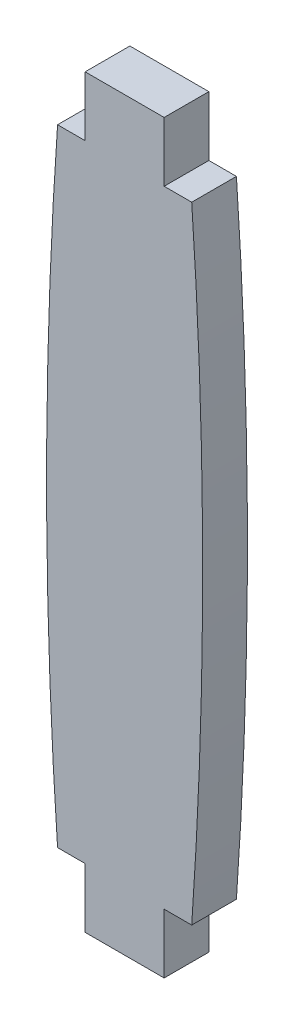
ISO-10303-21;
HEADER;
FILE_DESCRIPTION(('STEP AP214'),'2;1');
FILE_NAME('part.step','',(''),(''),'','','');
FILE_SCHEMA(('AUTOMOTIVE_DESIGN { 1 0 10303 214 1 1 1 1 }'));
ENDSEC;
DATA;
#1=APPLICATION_CONTEXT('core data for automotive mechanical design processes');
#2=APPLICATION_PROTOCOL_DEFINITION('international standard','automotive_design',2000,#1);
#3=PRODUCT_CONTEXT('',#1,'mechanical');
#4=PRODUCT('Part','Part','',(#3));
#5=PRODUCT_RELATED_PRODUCT_CATEGORY('part','',(#4));
#6=PRODUCT_DEFINITION_FORMATION('','',#4);
#7=PRODUCT_DEFINITION_CONTEXT('part definition',#1,'design');
#8=PRODUCT_DEFINITION('design','',#6,#7);
#9=PRODUCT_DEFINITION_SHAPE('','',#8);
#10=(LENGTH_UNIT() NAMED_UNIT(*) SI_UNIT(.MILLI.,.METRE.));
#11=(NAMED_UNIT(*) PLANE_ANGLE_UNIT() SI_UNIT($,.RADIAN.));
#12=(NAMED_UNIT(*) SI_UNIT($,.STERADIAN.) SOLID_ANGLE_UNIT());
#13=UNCERTAINTY_MEASURE_WITH_UNIT(LENGTH_MEASURE(1.E-05),#10,'distance_accuracy_value','');
#14=(GEOMETRIC_REPRESENTATION_CONTEXT(3) GLOBAL_UNCERTAINTY_ASSIGNED_CONTEXT((#13)) GLOBAL_UNIT_ASSIGNED_CONTEXT((#10,
#11,#12)) REPRESENTATION_CONTEXT('',''));
#15=CARTESIAN_POINT('',(0.,0.,0.));
#16=DIRECTION('',(0.,0.,1.));
#17=DIRECTION('',(1.,0.,0.));
#18=AXIS2_PLACEMENT_3D('',#15,#16,#17);
#19=CARTESIAN_POINT('',(299.264097412302,21.,3.));
#20=DIRECTION('',(0.,0.,-1.));
#21=DIRECTION('',(-1.,0.,0.));
#22=AXIS2_PLACEMENT_3D('',#19,#20,#21);
#23=CYLINDRICAL_SURFACE('',#22,300.);
#24=CARTESIAN_POINT('',(299.264097412302,21.,0.));
#25=DIRECTION('',(0.,0.,1.));
#26=DIRECTION('',(-1.,0.,0.));
#27=AXIS2_PLACEMENT_3D('',#24,#25,#26);
#28=CIRCLE('',#27,300.);
#29=CARTESIAN_POINT('',(0.,42.,0.));
#30=VERTEX_POINT('',#29);
#31=CARTESIAN_POINT('',(0.,0.,0.));
#32=VERTEX_POINT('',#31);
#33=EDGE_CURVE('E164',#30,#32,#28,.T.);
#34=ORIENTED_EDGE('',*,*,#33,.T.);
#35=DIRECTION('',(0.,0.,-1.));
#36=VECTOR('',#35,1.);
#37=CARTESIAN_POINT('',(0.,0.,3.));
#38=LINE('',#37,#36);
#39=CARTESIAN_POINT('',(0.,0.,3.));
#40=VERTEX_POINT('',#39);
#41=EDGE_CURVE('E11',#40,#32,#38,.T.);
#42=ORIENTED_EDGE('',*,*,#41,.F.);
#43=CARTESIAN_POINT('',(299.264097412302,21.,3.));
#44=DIRECTION('',(0.,0.,1.));
#45=DIRECTION('',(-1.,0.,0.));
#46=AXIS2_PLACEMENT_3D('',#43,#44,#45);
#47=CIRCLE('',#46,300.);
#48=CARTESIAN_POINT('',(0.,42.,3.));
#49=VERTEX_POINT('',#48);
#50=EDGE_CURVE('E198',#49,#40,#47,.T.);
#51=ORIENTED_EDGE('',*,*,#50,.F.);
#52=DIRECTION('',(0.,0.,-1.));
#53=VECTOR('',#52,1.);
#54=CARTESIAN_POINT('',(0.,42.,3.));
#55=LINE('',#54,#53);
#56=EDGE_CURVE('E160',#49,#30,#55,.T.);
#57=ORIENTED_EDGE('',*,*,#56,.T.);
#58=EDGE_LOOP('',(#34,#42,#51,#57));
#59=FACE_BOUND('',#58,.T.);
#60=ADVANCED_FACE('F39',(#59),#23,.T.);
#61=CARTESIAN_POINT('',(0.,0.,3.));
#62=DIRECTION('',(0.,1.,0.));
#63=DIRECTION('',(0.,0.,1.));
#64=AXIS2_PLACEMENT_3D('',#61,#62,#63);
#65=PLANE('',#64);
#66=DIRECTION('',(1.,0.,0.));
#67=VECTOR('',#66,1.);
#68=CARTESIAN_POINT('',(0.,0.,0.));
#69=LINE('',#68,#67);
#70=CARTESIAN_POINT('',(1.85,0.,0.));
#71=VERTEX_POINT('',#70);
#72=EDGE_CURVE('E168',#32,#71,#69,.T.);
#73=ORIENTED_EDGE('',*,*,#72,.T.);
#74=DIRECTION('',(0.,0.,-1.));
#75=VECTOR('',#74,1.);
#76=CARTESIAN_POINT('',(1.85,0.,3.));
#77=LINE('',#76,#75);
#78=CARTESIAN_POINT('',(1.85,0.,3.));
#79=VERTEX_POINT('',#78);
#80=EDGE_CURVE('E48',#79,#71,#77,.T.);
#81=ORIENTED_EDGE('',*,*,#80,.F.);
#82=DIRECTION('',(1.,0.,0.));
#83=VECTOR('',#82,1.);
#84=CARTESIAN_POINT('',(0.,0.,3.));
#85=LINE('',#84,#83);
#86=EDGE_CURVE('E111',#40,#79,#85,.T.);
#87=ORIENTED_EDGE('',*,*,#86,.F.);
#88=ORIENTED_EDGE('',*,*,#41,.T.);
#89=EDGE_LOOP('',(#73,#81,#87,#88));
#90=FACE_BOUND('',#89,.T.);
#91=ADVANCED_FACE('F292',(#90),#65,.F.);
#92=CARTESIAN_POINT('',(1.85,0.,3.));
#93=DIRECTION('',(1.,0.,0.));
#94=DIRECTION('',(0.,1.,0.));
#95=AXIS2_PLACEMENT_3D('',#92,#93,#94);
#96=PLANE('',#95);
#97=DIRECTION('',(0.,-1.,0.));
#98=VECTOR('',#97,1.);
#99=CARTESIAN_POINT('',(1.85,0.,0.));
#100=LINE('',#99,#98);
#101=CARTESIAN_POINT('',(1.85,-4.,0.));
#102=VERTEX_POINT('',#101);
#103=EDGE_CURVE('E171',#71,#102,#100,.T.);
#104=ORIENTED_EDGE('',*,*,#103,.T.);
#105=DIRECTION('',(0.,0.,-1.));
#106=VECTOR('',#105,1.);
#107=CARTESIAN_POINT('',(1.85,-4.,3.));
#108=LINE('',#107,#106);
#109=CARTESIAN_POINT('',(1.85,-4.,3.));
#110=VERTEX_POINT('',#109);
#111=EDGE_CURVE('E225',#110,#102,#108,.T.);
#112=ORIENTED_EDGE('',*,*,#111,.F.);
#113=DIRECTION('',(0.,-1.,0.));
#114=VECTOR('',#113,1.);
#115=CARTESIAN_POINT('',(1.85,0.,3.));
#116=LINE('',#115,#114);
#117=EDGE_CURVE('E235',#79,#110,#116,.T.);
#118=ORIENTED_EDGE('',*,*,#117,.F.);
#119=ORIENTED_EDGE('',*,*,#80,.T.);
#120=EDGE_LOOP('',(#104,#112,#118,#119));
#121=FACE_BOUND('',#120,.T.);
#122=ADVANCED_FACE('F233',(#121),#96,.F.);
#123=CARTESIAN_POINT('',(1.85,-4.,3.));
#124=DIRECTION('',(0.,1.,0.));
#125=DIRECTION('',(0.,0.,1.));
#126=AXIS2_PLACEMENT_3D('',#123,#124,#125);
#127=PLANE('',#126);
#128=DIRECTION('',(1.,0.,0.));
#129=VECTOR('',#128,1.);
#130=CARTESIAN_POINT('',(1.85,-4.,0.));
#131=LINE('',#130,#129);
#132=CARTESIAN_POINT('',(7.15,-4.,0.));
#133=VERTEX_POINT('',#132);
#134=EDGE_CURVE('E174',#102,#133,#131,.T.);
#135=ORIENTED_EDGE('',*,*,#134,.T.);
#136=DIRECTION('',(0.,0.,-1.));
#137=VECTOR('',#136,1.);
#138=CARTESIAN_POINT('',(7.15,-4.,3.));
#139=LINE('',#138,#137);
#140=CARTESIAN_POINT('',(7.15,-4.,3.));
#141=VERTEX_POINT('',#140);
#142=EDGE_CURVE('E221',#141,#133,#139,.T.);
#143=ORIENTED_EDGE('',*,*,#142,.F.);
#144=DIRECTION('',(1.,0.,0.));
#145=VECTOR('',#144,1.);
#146=CARTESIAN_POINT('',(1.85,-4.,3.));
#147=LINE('',#146,#145);
#148=EDGE_CURVE('E254',#110,#141,#147,.T.);
#149=ORIENTED_EDGE('',*,*,#148,.F.);
#150=ORIENTED_EDGE('',*,*,#111,.T.);
#151=EDGE_LOOP('',(#135,#143,#149,#150));
#152=FACE_BOUND('',#151,.T.);
#153=ADVANCED_FACE('F244',(#152),#127,.F.);
#154=CARTESIAN_POINT('',(7.15,-4.,3.));
#155=DIRECTION('',(-1.,0.,0.));
#156=DIRECTION('',(0.,0.,1.));
#157=AXIS2_PLACEMENT_3D('',#154,#155,#156);
#158=PLANE('',#157);
#159=DIRECTION('',(0.,1.,0.));
#160=VECTOR('',#159,1.);
#161=CARTESIAN_POINT('',(7.15,-4.,0.));
#162=LINE('',#161,#160);
#163=CARTESIAN_POINT('',(7.15,0.,0.));
#164=VERTEX_POINT('',#163);
#165=EDGE_CURVE('E177',#133,#164,#162,.T.);
#166=ORIENTED_EDGE('',*,*,#165,.T.);
#167=DIRECTION('',(0.,0.,-1.));
#168=VECTOR('',#167,1.);
#169=CARTESIAN_POINT('',(7.15,0.,3.));
#170=LINE('',#169,#168);
#171=CARTESIAN_POINT('',(7.15,0.,3.));
#172=VERTEX_POINT('',#171);
#173=EDGE_CURVE('E217',#172,#164,#170,.T.);
#174=ORIENTED_EDGE('',*,*,#173,.F.);
#175=DIRECTION('',(0.,1.,0.));
#176=VECTOR('',#175,1.);
#177=CARTESIAN_POINT('',(7.15,-4.,3.));
#178=LINE('',#177,#176);
#179=EDGE_CURVE('E250',#141,#172,#178,.T.);
#180=ORIENTED_EDGE('',*,*,#179,.F.);
#181=ORIENTED_EDGE('',*,*,#142,.T.);
#182=EDGE_LOOP('',(#166,#174,#180,#181));
#183=FACE_BOUND('',#182,.T.);
#184=ADVANCED_FACE('F248',(#183),#158,.F.);
#185=CARTESIAN_POINT('',(7.15,0.,3.));
#186=DIRECTION('',(0.,1.,0.));
#187=DIRECTION('',(0.,0.,1.));
#188=AXIS2_PLACEMENT_3D('',#185,#186,#187);
#189=PLANE('',#188);
#190=DIRECTION('',(1.,0.,0.));
#191=VECTOR('',#190,1.);
#192=CARTESIAN_POINT('',(7.15,0.,0.));
#193=LINE('',#192,#191);
#194=CARTESIAN_POINT('',(9.,0.,0.));
#195=VERTEX_POINT('',#194);
#196=EDGE_CURVE('E180',#164,#195,#193,.T.);
#197=ORIENTED_EDGE('',*,*,#196,.T.);
#198=DIRECTION('',(0.,0.,-1.));
#199=VECTOR('',#198,1.);
#200=CARTESIAN_POINT('',(9.,0.,3.));
#201=LINE('',#200,#199);
#202=CARTESIAN_POINT('',(9.,0.,3.));
#203=VERTEX_POINT('',#202);
#204=EDGE_CURVE('E213',#203,#195,#201,.T.);
#205=ORIENTED_EDGE('',*,*,#204,.F.);
#206=DIRECTION('',(1.,0.,0.));
#207=VECTOR('',#206,1.);
#208=CARTESIAN_POINT('',(7.15,0.,3.));
#209=LINE('',#208,#207);
#210=EDGE_CURVE('E253',#172,#203,#209,.T.);
#211=ORIENTED_EDGE('',*,*,#210,.F.);
#212=ORIENTED_EDGE('',*,*,#173,.T.);
#213=EDGE_LOOP('',(#197,#205,#211,#212));
#214=FACE_BOUND('',#213,.T.);
#215=ADVANCED_FACE('F305',(#214),#189,.F.);
#216=CARTESIAN_POINT('',(-290.264097412302,21.,3.));
#217=DIRECTION('',(0.,0.,-1.));
#218=DIRECTION('',(-1.,0.,0.));
#219=AXIS2_PLACEMENT_3D('',#216,#217,#218);
#220=CYLINDRICAL_SURFACE('',#219,300.);
#221=CARTESIAN_POINT('',(-290.264097412302,21.,0.));
#222=DIRECTION('',(0.,0.,1.));
#223=DIRECTION('',(1.,0.,0.));
#224=AXIS2_PLACEMENT_3D('',#221,#222,#223);
#225=CIRCLE('',#224,300.);
#226=CARTESIAN_POINT('',(9.00000000000001,42.,0.));
#227=VERTEX_POINT('',#226);
#228=EDGE_CURVE('E183',#195,#227,#225,.T.);
#229=ORIENTED_EDGE('',*,*,#228,.T.);
#230=DIRECTION('',(0.,0.,-1.));
#231=VECTOR('',#230,1.);
#232=CARTESIAN_POINT('',(9.00000000000001,42.,3.));
#233=LINE('',#232,#231);
#234=CARTESIAN_POINT('',(9.00000000000001,42.,3.));
#235=VERTEX_POINT('',#234);
#236=EDGE_CURVE('E209',#235,#227,#233,.T.);
#237=ORIENTED_EDGE('',*,*,#236,.F.);
#238=CARTESIAN_POINT('',(-290.264097412302,21.,3.));
#239=DIRECTION('',(0.,0.,1.));
#240=DIRECTION('',(1.,0.,0.));
#241=AXIS2_PLACEMENT_3D('',#238,#239,#240);
#242=CIRCLE('',#241,300.);
#243=EDGE_CURVE('E258',#203,#235,#242,.T.);
#244=ORIENTED_EDGE('',*,*,#243,.F.);
#245=ORIENTED_EDGE('',*,*,#204,.T.);
#246=EDGE_LOOP('',(#229,#237,#244,#245));
#247=FACE_BOUND('',#246,.T.);
#248=ADVANCED_FACE('F308',(#247),#220,.T.);
#249=CARTESIAN_POINT('',(7.15000000000001,42.,3.));
#250=DIRECTION('',(0.,-1.,0.));
#251=DIRECTION('',(0.,0.,-1.));
#252=AXIS2_PLACEMENT_3D('',#249,#250,#251);
#253=PLANE('',#252);
#254=DIRECTION('',(-1.,0.,0.));
#255=VECTOR('',#254,1.);
#256=CARTESIAN_POINT('',(7.15000000000001,42.,0.));
#257=LINE('',#256,#255);
#258=CARTESIAN_POINT('',(7.15000000000001,42.,0.));
#259=VERTEX_POINT('',#258);
#260=EDGE_CURVE('E186',#227,#259,#257,.T.);
#261=ORIENTED_EDGE('',*,*,#260,.T.);
#262=DIRECTION('',(0.,0.,-1.));
#263=VECTOR('',#262,1.);
#264=CARTESIAN_POINT('',(7.15000000000001,42.,3.));
#265=LINE('',#264,#263);
#266=CARTESIAN_POINT('',(7.15000000000001,42.,3.));
#267=VERTEX_POINT('',#266);
#268=EDGE_CURVE('E205',#267,#259,#265,.T.);
#269=ORIENTED_EDGE('',*,*,#268,.F.);
#270=DIRECTION('',(-1.,0.,0.));
#271=VECTOR('',#270,1.);
#272=CARTESIAN_POINT('',(7.15000000000001,42.,3.));
#273=LINE('',#272,#271);
#274=EDGE_CURVE('E265',#235,#267,#273,.T.);
#275=ORIENTED_EDGE('',*,*,#274,.F.);
#276=ORIENTED_EDGE('',*,*,#236,.T.);
#277=EDGE_LOOP('',(#261,#269,#275,#276));
#278=FACE_BOUND('',#277,.T.);
#279=ADVANCED_FACE('F273',(#278),#253,.F.);
#280=CARTESIAN_POINT('',(7.15,46.,3.));
#281=DIRECTION('',(-1.,0.,0.));
#282=DIRECTION('',(0.,-1.,0.));
#283=AXIS2_PLACEMENT_3D('',#280,#281,#282);
#284=PLANE('',#283);
#285=DIRECTION('',(0.,1.,0.));
#286=VECTOR('',#285,1.);
#287=CARTESIAN_POINT('',(7.15,46.,0.));
#288=LINE('',#287,#286);
#289=CARTESIAN_POINT('',(7.15,46.,0.));
#290=VERTEX_POINT('',#289);
#291=EDGE_CURVE('E189',#259,#290,#288,.T.);
#292=ORIENTED_EDGE('',*,*,#291,.T.);
#293=DIRECTION('',(0.,0.,-1.));
#294=VECTOR('',#293,1.);
#295=CARTESIAN_POINT('',(7.15,46.,3.));
#296=LINE('',#295,#294);
#297=CARTESIAN_POINT('',(7.15,46.,3.));
#298=VERTEX_POINT('',#297);
#299=EDGE_CURVE('E153',#298,#290,#296,.T.);
#300=ORIENTED_EDGE('',*,*,#299,.F.);
#301=DIRECTION('',(0.,1.,0.));
#302=VECTOR('',#301,1.);
#303=CARTESIAN_POINT('',(7.15,46.,3.));
#304=LINE('',#303,#302);
#305=EDGE_CURVE('E142',#267,#298,#304,.T.);
#306=ORIENTED_EDGE('',*,*,#305,.F.);
#307=ORIENTED_EDGE('',*,*,#268,.T.);
#308=EDGE_LOOP('',(#292,#300,#306,#307));
#309=FACE_BOUND('',#308,.T.);
#310=ADVANCED_FACE('F277',(#309),#284,.F.);
#311=CARTESIAN_POINT('',(1.85,46.,3.));
#312=DIRECTION('',(0.,-1.,0.));
#313=DIRECTION('',(0.,0.,-1.));
#314=AXIS2_PLACEMENT_3D('',#311,#312,#313);
#315=PLANE('',#314);
#316=DIRECTION('',(-1.,0.,0.));
#317=VECTOR('',#316,1.);
#318=CARTESIAN_POINT('',(1.85,46.,0.));
#319=LINE('',#318,#317);
#320=CARTESIAN_POINT('',(1.85,46.,0.));
#321=VERTEX_POINT('',#320);
#322=EDGE_CURVE('E151',#290,#321,#319,.T.);
#323=ORIENTED_EDGE('',*,*,#322,.T.);
#324=DIRECTION('',(0.,0.,-1.));
#325=VECTOR('',#324,1.);
#326=CARTESIAN_POINT('',(1.85,46.,3.));
#327=LINE('',#326,#325);
#328=CARTESIAN_POINT('',(1.85,46.,3.));
#329=VERTEX_POINT('',#328);
#330=EDGE_CURVE('E148',#329,#321,#327,.T.);
#331=ORIENTED_EDGE('',*,*,#330,.F.);
#332=DIRECTION('',(-1.,0.,0.));
#333=VECTOR('',#332,1.);
#334=CARTESIAN_POINT('',(1.85,46.,3.));
#335=LINE('',#334,#333);
#336=EDGE_CURVE('E136',#298,#329,#335,.T.);
#337=ORIENTED_EDGE('',*,*,#336,.F.);
#338=ORIENTED_EDGE('',*,*,#299,.T.);
#339=EDGE_LOOP('',(#323,#331,#337,#338));
#340=FACE_BOUND('',#339,.T.);
#341=ADVANCED_FACE('F149',(#340),#315,.F.);
#342=CARTESIAN_POINT('',(1.84999999999999,42.,3.));
#343=DIRECTION('',(1.,0.,0.));
#344=DIRECTION('',(0.,1.,0.));
#345=AXIS2_PLACEMENT_3D('',#342,#343,#344);
#346=PLANE('',#345);
#347=DIRECTION('',(0.,-1.,0.));
#348=VECTOR('',#347,1.);
#349=CARTESIAN_POINT('',(1.84999999999999,42.,0.));
#350=LINE('',#349,#348);
#351=CARTESIAN_POINT('',(1.84999999999999,42.,0.));
#352=VERTEX_POINT('',#351);
#353=EDGE_CURVE('E97',#321,#352,#350,.T.);
#354=ORIENTED_EDGE('',*,*,#353,.T.);
#355=DIRECTION('',(0.,0.,-1.));
#356=VECTOR('',#355,1.);
#357=CARTESIAN_POINT('',(1.84999999999999,42.,3.));
#358=LINE('',#357,#356);
#359=CARTESIAN_POINT('',(1.84999999999999,42.,3.));
#360=VERTEX_POINT('',#359);
#361=EDGE_CURVE('E154',#360,#352,#358,.T.);
#362=ORIENTED_EDGE('',*,*,#361,.F.);
#363=DIRECTION('',(0.,-1.,0.));
#364=VECTOR('',#363,1.);
#365=CARTESIAN_POINT('',(1.84999999999999,42.,3.));
#366=LINE('',#365,#364);
#367=EDGE_CURVE('E140',#329,#360,#366,.T.);
#368=ORIENTED_EDGE('',*,*,#367,.F.);
#369=ORIENTED_EDGE('',*,*,#330,.T.);
#370=EDGE_LOOP('',(#354,#362,#368,#369));
#371=FACE_BOUND('',#370,.T.);
#372=ADVANCED_FACE('F156',(#371),#346,.F.);
#373=CARTESIAN_POINT('',(0.,42.,3.));
#374=DIRECTION('',(0.,-1.,0.));
#375=DIRECTION('',(0.,0.,-1.));
#376=AXIS2_PLACEMENT_3D('',#373,#374,#375);
#377=PLANE('',#376);
#378=DIRECTION('',(-1.,0.,0.));
#379=VECTOR('',#378,1.);
#380=CARTESIAN_POINT('',(0.,42.,0.));
#381=LINE('',#380,#379);
#382=EDGE_CURVE('E103',#352,#30,#381,.T.);
#383=ORIENTED_EDGE('',*,*,#382,.T.);
#384=ORIENTED_EDGE('',*,*,#56,.F.);
#385=DIRECTION('',(-1.,0.,0.));
#386=VECTOR('',#385,1.);
#387=CARTESIAN_POINT('',(0.,42.,3.));
#388=LINE('',#387,#386);
#389=EDGE_CURVE('E56',#360,#49,#388,.T.);
#390=ORIENTED_EDGE('',*,*,#389,.F.);
#391=ORIENTED_EDGE('',*,*,#361,.T.);
#392=EDGE_LOOP('',(#383,#384,#390,#391));
#393=FACE_BOUND('',#392,.T.);
#394=ADVANCED_FACE('F281',(#393),#377,.F.);
#395=CARTESIAN_POINT('',(299.264097412302,21.,3.));
#396=DIRECTION('',(0.,0.,-1.));
#397=DIRECTION('',(-1.,0.,0.));
#398=AXIS2_PLACEMENT_3D('',#395,#396,#397);
#399=PLANE('',#398);
#400=ORIENTED_EDGE('',*,*,#50,.T.);
#401=ORIENTED_EDGE('',*,*,#86,.T.);
#402=ORIENTED_EDGE('',*,*,#117,.T.);
#403=ORIENTED_EDGE('',*,*,#148,.T.);
#404=ORIENTED_EDGE('',*,*,#179,.T.);
#405=ORIENTED_EDGE('',*,*,#210,.T.);
#406=ORIENTED_EDGE('',*,*,#243,.T.);
#407=ORIENTED_EDGE('',*,*,#274,.T.);
#408=ORIENTED_EDGE('',*,*,#305,.T.);
#409=ORIENTED_EDGE('',*,*,#336,.T.);
#410=ORIENTED_EDGE('',*,*,#367,.T.);
#411=ORIENTED_EDGE('',*,*,#389,.T.);
#412=EDGE_LOOP('',(#400,#401,#402,#403,#404,#405,#406,#407,#408,#409,#410,#411));
#413=FACE_BOUND('',#412,.T.);
#414=ADVANCED_FACE('F138',(#413),#399,.F.);
#415=CARTESIAN_POINT('',(299.264097412302,21.,0.));
#416=DIRECTION('',(0.,0.,-1.));
#417=DIRECTION('',(-1.,0.,0.));
#418=AXIS2_PLACEMENT_3D('',#415,#416,#417);
#419=PLANE('',#418);
#420=ORIENTED_EDGE('',*,*,#33,.F.);
#421=ORIENTED_EDGE('',*,*,#382,.F.);
#422=ORIENTED_EDGE('',*,*,#353,.F.);
#423=ORIENTED_EDGE('',*,*,#322,.F.);
#424=ORIENTED_EDGE('',*,*,#291,.F.);
#425=ORIENTED_EDGE('',*,*,#260,.F.);
#426=ORIENTED_EDGE('',*,*,#228,.F.);
#427=ORIENTED_EDGE('',*,*,#196,.F.);
#428=ORIENTED_EDGE('',*,*,#165,.F.);
#429=ORIENTED_EDGE('',*,*,#134,.F.);
#430=ORIENTED_EDGE('',*,*,#103,.F.);
#431=ORIENTED_EDGE('',*,*,#72,.F.);
#432=EDGE_LOOP('',(#420,#421,#422,#423,#424,#425,#426,#427,#428,#429,#430,#431));
#433=FACE_BOUND('',#432,.T.);
#434=ADVANCED_FACE('F239',(#433),#419,.T.);
#435=CLOSED_SHELL('',(#60,#91,#122,#153,#184,#215,#248,#279,#310,#341,#372,#394,#414,#434));
#436=MANIFOLD_SOLID_BREP('B2',#435);
#437=ADVANCED_BREP_SHAPE_REPRESENTATION('',(#18,#436),#14);
#438=SHAPE_DEFINITION_REPRESENTATION(#9,#437);
ENDSEC;
END-ISO-10303-21;
